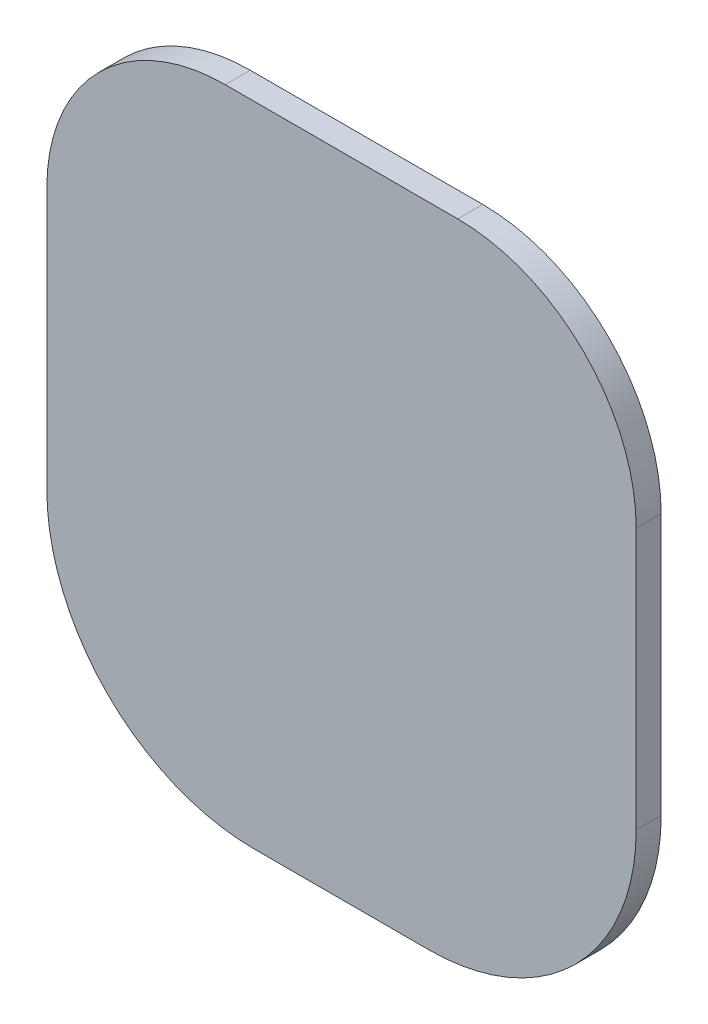
ISO-10303-21;
HEADER;
FILE_DESCRIPTION(('STEP AP214'),'2;1');
FILE_NAME('part.step','',(''),(''),'','','');
FILE_SCHEMA(('AUTOMOTIVE_DESIGN { 1 0 10303 214 1 1 1 1 }'));
ENDSEC;
DATA;
#1=APPLICATION_CONTEXT('core data for automotive mechanical design processes');
#2=APPLICATION_PROTOCOL_DEFINITION('international standard','automotive_design',2000,#1);
#3=PRODUCT_CONTEXT('',#1,'mechanical');
#4=PRODUCT('Part','Part','',(#3));
#5=PRODUCT_RELATED_PRODUCT_CATEGORY('part','',(#4));
#6=PRODUCT_DEFINITION_FORMATION('','',#4);
#7=PRODUCT_DEFINITION_CONTEXT('part definition',#1,'design');
#8=PRODUCT_DEFINITION('design','',#6,#7);
#9=PRODUCT_DEFINITION_SHAPE('','',#8);
#10=(LENGTH_UNIT() NAMED_UNIT(*) SI_UNIT(.MILLI.,.METRE.));
#11=(NAMED_UNIT(*) PLANE_ANGLE_UNIT() SI_UNIT($,.RADIAN.));
#12=(NAMED_UNIT(*) SI_UNIT($,.STERADIAN.) SOLID_ANGLE_UNIT());
#13=UNCERTAINTY_MEASURE_WITH_UNIT(LENGTH_MEASURE(1.E-05),#10,'distance_accuracy_value','');
#14=(GEOMETRIC_REPRESENTATION_CONTEXT(3) GLOBAL_UNCERTAINTY_ASSIGNED_CONTEXT((#13)) GLOBAL_UNIT_ASSIGNED_CONTEXT((#10,
#11,#12)) REPRESENTATION_CONTEXT('',''));
#15=CARTESIAN_POINT('',(0.,0.,0.));
#16=DIRECTION('',(0.,0.,1.));
#17=DIRECTION('',(1.,0.,0.));
#18=AXIS2_PLACEMENT_3D('',#15,#16,#17);
#19=CARTESIAN_POINT('',(-20.,17.,4.3));
#20=DIRECTION('',(0.,0.,-1.));
#21=DIRECTION('',(-1.,0.,0.));
#22=AXIS2_PLACEMENT_3D('',#19,#20,#21);
#23=CYLINDRICAL_SURFACE('',#22,30.7);
#24=CARTESIAN_POINT('',(-20.,17.,0.));
#25=DIRECTION('',(0.,0.,1.));
#26=DIRECTION('',(-1.,0.,0.));
#27=AXIS2_PLACEMENT_3D('',#24,#25,#26);
#28=CIRCLE('',#27,30.7);
#29=CARTESIAN_POINT('',(-20.,47.7,0.));
#30=VERTEX_POINT('',#29);
#31=CARTESIAN_POINT('',(-50.7,17.,0.));
#32=VERTEX_POINT('',#31);
#33=EDGE_CURVE('E140',#30,#32,#28,.T.);
#34=ORIENTED_EDGE('',*,*,#33,.T.);
#35=DIRECTION('',(0.,0.,-1.));
#36=VECTOR('',#35,1.);
#37=CARTESIAN_POINT('',(-50.7,17.,4.3));
#38=LINE('',#37,#36);
#39=CARTESIAN_POINT('',(-50.7,17.,4.3));
#40=VERTEX_POINT('',#39);
#41=EDGE_CURVE('E11',#40,#32,#38,.T.);
#42=ORIENTED_EDGE('',*,*,#41,.F.);
#43=CARTESIAN_POINT('',(-20.,17.,4.3));
#44=DIRECTION('',(0.,0.,1.));
#45=DIRECTION('',(-1.,0.,0.));
#46=AXIS2_PLACEMENT_3D('',#43,#44,#45);
#47=CIRCLE('',#46,30.7);
#48=CARTESIAN_POINT('',(-20.,47.7,4.3));
#49=VERTEX_POINT('',#48);
#50=EDGE_CURVE('E163',#49,#40,#47,.T.);
#51=ORIENTED_EDGE('',*,*,#50,.F.);
#52=DIRECTION('',(0.,0.,-1.));
#53=VECTOR('',#52,1.);
#54=CARTESIAN_POINT('',(-20.,47.7,4.3));
#55=LINE('',#54,#53);
#56=EDGE_CURVE('E136',#49,#30,#55,.T.);
#57=ORIENTED_EDGE('',*,*,#56,.T.);
#58=EDGE_LOOP('',(#34,#42,#51,#57));
#59=FACE_BOUND('',#58,.T.);
#60=ADVANCED_FACE('F39',(#59),#23,.T.);
#61=CARTESIAN_POINT('',(-50.7,17.,4.3));
#62=DIRECTION('',(1.,0.,0.));
#63=DIRECTION('',(0.,1.,0.));
#64=AXIS2_PLACEMENT_3D('',#61,#62,#63);
#65=PLANE('',#64);
#66=DIRECTION('',(0.,-1.,0.));
#67=VECTOR('',#66,1.);
#68=CARTESIAN_POINT('',(-50.7,17.,0.));
#69=LINE('',#68,#67);
#70=CARTESIAN_POINT('',(-50.7,-28.,0.));
#71=VERTEX_POINT('',#70);
#72=EDGE_CURVE('E144',#32,#71,#69,.T.);
#73=ORIENTED_EDGE('',*,*,#72,.T.);
#74=DIRECTION('',(0.,0.,-1.));
#75=VECTOR('',#74,1.);
#76=CARTESIAN_POINT('',(-50.7,-28.,4.3));
#77=LINE('',#76,#75);
#78=CARTESIAN_POINT('',(-50.7,-28.,4.3));
#79=VERTEX_POINT('',#78);
#80=EDGE_CURVE('E48',#79,#71,#77,.T.);
#81=ORIENTED_EDGE('',*,*,#80,.F.);
#82=DIRECTION('',(0.,-1.,0.));
#83=VECTOR('',#82,1.);
#84=CARTESIAN_POINT('',(-50.7,17.,4.3));
#85=LINE('',#84,#83);
#86=EDGE_CURVE('E99',#40,#79,#85,.T.);
#87=ORIENTED_EDGE('',*,*,#86,.F.);
#88=ORIENTED_EDGE('',*,*,#41,.T.);
#89=EDGE_LOOP('',(#73,#81,#87,#88));
#90=FACE_BOUND('',#89,.T.);
#91=ADVANCED_FACE('F208',(#90),#65,.F.);
#92=CARTESIAN_POINT('',(-15.,-28.,4.3));
#93=DIRECTION('',(0.,0.,-1.));
#94=DIRECTION('',(-1.,0.,0.));
#95=AXIS2_PLACEMENT_3D('',#92,#93,#94);
#96=CYLINDRICAL_SURFACE('',#95,35.7);
#97=CARTESIAN_POINT('',(-15.,-28.,0.));
#98=DIRECTION('',(0.,0.,1.));
#99=DIRECTION('',(1.,0.,0.));
#100=AXIS2_PLACEMENT_3D('',#97,#98,#99);
#101=CIRCLE('',#100,35.7);
#102=CARTESIAN_POINT('',(-15.,-63.7,0.));
#103=VERTEX_POINT('',#102);
#104=EDGE_CURVE('E147',#71,#103,#101,.T.);
#105=ORIENTED_EDGE('',*,*,#104,.T.);
#106=DIRECTION('',(0.,0.,-1.));
#107=VECTOR('',#106,1.);
#108=CARTESIAN_POINT('',(-15.,-63.7,4.3));
#109=LINE('',#108,#107);
#110=CARTESIAN_POINT('',(-15.,-63.7,4.3));
#111=VERTEX_POINT('',#110);
#112=EDGE_CURVE('E174',#111,#103,#109,.T.);
#113=ORIENTED_EDGE('',*,*,#112,.F.);
#114=CARTESIAN_POINT('',(-15.,-28.,4.3));
#115=DIRECTION('',(0.,0.,1.));
#116=DIRECTION('',(1.,0.,0.));
#117=AXIS2_PLACEMENT_3D('',#114,#115,#116);
#118=CIRCLE('',#117,35.7);
#119=EDGE_CURVE('E184',#79,#111,#118,.T.);
#120=ORIENTED_EDGE('',*,*,#119,.F.);
#121=ORIENTED_EDGE('',*,*,#80,.T.);
#122=EDGE_LOOP('',(#105,#113,#120,#121));
#123=FACE_BOUND('',#122,.T.);
#124=ADVANCED_FACE('F182',(#123),#96,.T.);
#125=CARTESIAN_POINT('',(0.500000000000017,-63.7,4.3));
#126=DIRECTION('',(0.,1.,0.));
#127=DIRECTION('',(0.,0.,1.));
#128=AXIS2_PLACEMENT_3D('',#125,#126,#127);
#129=PLANE('',#128);
#130=DIRECTION('',(1.,0.,0.));
#131=VECTOR('',#130,1.);
#132=CARTESIAN_POINT('',(0.500000000000017,-63.7,0.));
#133=LINE('',#132,#131);
#134=CARTESIAN_POINT('',(15.,-63.7,0.));
#135=VERTEX_POINT('',#134);
#136=EDGE_CURVE('E151',#103,#135,#133,.T.);
#137=ORIENTED_EDGE('',*,*,#136,.T.);
#138=DIRECTION('',(0.,0.,-1.));
#139=VECTOR('',#138,1.);
#140=CARTESIAN_POINT('',(15.,-63.7,4.3));
#141=LINE('',#140,#139);
#142=CARTESIAN_POINT('',(15.,-63.7,4.3));
#143=VERTEX_POINT('',#142);
#144=EDGE_CURVE('E170',#143,#135,#141,.T.);
#145=ORIENTED_EDGE('',*,*,#144,.F.);
#146=DIRECTION('',(1.,0.,0.));
#147=VECTOR('',#146,1.);
#148=CARTESIAN_POINT('',(-15.,-63.7,4.3));
#149=LINE('',#148,#147);
#150=EDGE_CURVE('E196',#111,#143,#149,.T.);
#151=ORIENTED_EDGE('',*,*,#150,.F.);
#152=ORIENTED_EDGE('',*,*,#112,.T.);
#153=EDGE_LOOP('',(#137,#145,#151,#152));
#154=FACE_BOUND('',#153,.T.);
#155=ADVANCED_FACE('F191',(#154),#129,.F.);
#156=CARTESIAN_POINT('',(15.,-28.,4.3));
#157=DIRECTION('',(0.,0.,-1.));
#158=DIRECTION('',(-1.,0.,0.));
#159=AXIS2_PLACEMENT_3D('',#156,#157,#158);
#160=CYLINDRICAL_SURFACE('',#159,35.7);
#161=CARTESIAN_POINT('',(15.,-28.,0.));
#162=DIRECTION('',(0.,0.,1.));
#163=DIRECTION('',(1.,0.,0.));
#164=AXIS2_PLACEMENT_3D('',#161,#162,#163);
#165=CIRCLE('',#164,35.7);
#166=CARTESIAN_POINT('',(50.7,-28.,0.));
#167=VERTEX_POINT('',#166);
#168=EDGE_CURVE('E154',#135,#167,#165,.T.);
#169=ORIENTED_EDGE('',*,*,#168,.T.);
#170=DIRECTION('',(0.,0.,-1.));
#171=VECTOR('',#170,1.);
#172=CARTESIAN_POINT('',(50.7,-28.,4.3));
#173=LINE('',#172,#171);
#174=CARTESIAN_POINT('',(50.7,-28.,4.3));
#175=VERTEX_POINT('',#174);
#176=EDGE_CURVE('E129',#175,#167,#173,.T.);
#177=ORIENTED_EDGE('',*,*,#176,.F.);
#178=CARTESIAN_POINT('',(15.,-28.,4.3));
#179=DIRECTION('',(0.,0.,1.));
#180=DIRECTION('',(1.,0.,0.));
#181=AXIS2_PLACEMENT_3D('',#178,#179,#180);
#182=CIRCLE('',#181,35.7);
#183=EDGE_CURVE('E118',#143,#175,#182,.T.);
#184=ORIENTED_EDGE('',*,*,#183,.F.);
#185=ORIENTED_EDGE('',*,*,#144,.T.);
#186=EDGE_LOOP('',(#169,#177,#184,#185));
#187=FACE_BOUND('',#186,.T.);
#188=ADVANCED_FACE('F194',(#187),#160,.T.);
#189=CARTESIAN_POINT('',(50.7,17.,4.3));
#190=DIRECTION('',(-1.,0.,0.));
#191=DIRECTION('',(0.,-1.,0.));
#192=AXIS2_PLACEMENT_3D('',#189,#190,#191);
#193=PLANE('',#192);
#194=DIRECTION('',(0.,1.,0.));
#195=VECTOR('',#194,1.);
#196=CARTESIAN_POINT('',(50.7,17.,0.));
#197=LINE('',#196,#195);
#198=CARTESIAN_POINT('',(50.7,17.,0.));
#199=VERTEX_POINT('',#198);
#200=EDGE_CURVE('E127',#167,#199,#197,.T.);
#201=ORIENTED_EDGE('',*,*,#200,.T.);
#202=DIRECTION('',(0.,0.,-1.));
#203=VECTOR('',#202,1.);
#204=CARTESIAN_POINT('',(50.7,17.,4.3));
#205=LINE('',#204,#203);
#206=CARTESIAN_POINT('',(50.7,17.,4.3));
#207=VERTEX_POINT('',#206);
#208=EDGE_CURVE('E124',#207,#199,#205,.T.);
#209=ORIENTED_EDGE('',*,*,#208,.F.);
#210=DIRECTION('',(0.,1.,0.));
#211=VECTOR('',#210,1.);
#212=CARTESIAN_POINT('',(50.7,17.,4.3));
#213=LINE('',#212,#211);
#214=EDGE_CURVE('E112',#175,#207,#213,.T.);
#215=ORIENTED_EDGE('',*,*,#214,.F.);
#216=ORIENTED_EDGE('',*,*,#176,.T.);
#217=EDGE_LOOP('',(#201,#209,#215,#216));
#218=FACE_BOUND('',#217,.T.);
#219=ADVANCED_FACE('F125',(#218),#193,.F.);
#220=CARTESIAN_POINT('',(20.,17.,4.3));
#221=DIRECTION('',(0.,0.,-1.));
#222=DIRECTION('',(-1.,0.,0.));
#223=AXIS2_PLACEMENT_3D('',#220,#221,#222);
#224=CYLINDRICAL_SURFACE('',#223,30.7);
#225=CARTESIAN_POINT('',(20.,17.,0.));
#226=DIRECTION('',(0.,0.,1.));
#227=DIRECTION('',(-1.,0.,0.));
#228=AXIS2_PLACEMENT_3D('',#225,#226,#227);
#229=CIRCLE('',#228,30.7);
#230=CARTESIAN_POINT('',(20.,47.7,0.));
#231=VERTEX_POINT('',#230);
#232=EDGE_CURVE('E85',#199,#231,#229,.T.);
#233=ORIENTED_EDGE('',*,*,#232,.T.);
#234=DIRECTION('',(0.,0.,-1.));
#235=VECTOR('',#234,1.);
#236=CARTESIAN_POINT('',(20.,47.7,4.3));
#237=LINE('',#236,#235);
#238=CARTESIAN_POINT('',(20.,47.7,4.3));
#239=VERTEX_POINT('',#238);
#240=EDGE_CURVE('E130',#239,#231,#237,.T.);
#241=ORIENTED_EDGE('',*,*,#240,.F.);
#242=CARTESIAN_POINT('',(20.,17.,4.3));
#243=DIRECTION('',(0.,0.,1.));
#244=DIRECTION('',(-1.,0.,0.));
#245=AXIS2_PLACEMENT_3D('',#242,#243,#244);
#246=CIRCLE('',#245,30.7);
#247=EDGE_CURVE('E116',#207,#239,#246,.T.);
#248=ORIENTED_EDGE('',*,*,#247,.F.);
#249=ORIENTED_EDGE('',*,*,#208,.T.);
#250=EDGE_LOOP('',(#233,#241,#248,#249));
#251=FACE_BOUND('',#250,.T.);
#252=ADVANCED_FACE('F132',(#251),#224,.T.);
#253=CARTESIAN_POINT('',(-20.,47.7,4.3));
#254=DIRECTION('',(0.,-1.,0.));
#255=DIRECTION('',(1.,0.,0.));
#256=AXIS2_PLACEMENT_3D('',#253,#254,#255);
#257=PLANE('',#256);
#258=DIRECTION('',(-1.,0.,0.));
#259=VECTOR('',#258,1.);
#260=CARTESIAN_POINT('',(-20.,47.7,0.));
#261=LINE('',#260,#259);
#262=EDGE_CURVE('E91',#231,#30,#261,.T.);
#263=ORIENTED_EDGE('',*,*,#262,.T.);
#264=ORIENTED_EDGE('',*,*,#56,.F.);
#265=DIRECTION('',(-1.,0.,0.));
#266=VECTOR('',#265,1.);
#267=CARTESIAN_POINT('',(-20.,47.7,4.3));
#268=LINE('',#267,#266);
#269=EDGE_CURVE('E56',#239,#49,#268,.T.);
#270=ORIENTED_EDGE('',*,*,#269,.F.);
#271=ORIENTED_EDGE('',*,*,#240,.T.);
#272=EDGE_LOOP('',(#263,#264,#270,#271));
#273=FACE_BOUND('',#272,.T.);
#274=ADVANCED_FACE('F224',(#273),#257,.F.);
#275=CARTESIAN_POINT('',(-20.,17.,4.3));
#276=DIRECTION('',(0.,0.,-1.));
#277=DIRECTION('',(-1.,0.,0.));
#278=AXIS2_PLACEMENT_3D('',#275,#276,#277);
#279=PLANE('',#278);
#280=ORIENTED_EDGE('',*,*,#50,.T.);
#281=ORIENTED_EDGE('',*,*,#86,.T.);
#282=ORIENTED_EDGE('',*,*,#119,.T.);
#283=ORIENTED_EDGE('',*,*,#150,.T.);
#284=ORIENTED_EDGE('',*,*,#183,.T.);
#285=ORIENTED_EDGE('',*,*,#214,.T.);
#286=ORIENTED_EDGE('',*,*,#247,.T.);
#287=ORIENTED_EDGE('',*,*,#269,.T.);
#288=EDGE_LOOP('',(#280,#281,#282,#283,#284,#285,#286,#287));
#289=FACE_BOUND('',#288,.T.);
#290=ADVANCED_FACE('F114',(#289),#279,.F.);
#291=CARTESIAN_POINT('',(-20.,17.,0.));
#292=DIRECTION('',(0.,0.,-1.));
#293=DIRECTION('',(-1.,0.,0.));
#294=AXIS2_PLACEMENT_3D('',#291,#292,#293);
#295=PLANE('',#294);
#296=ORIENTED_EDGE('',*,*,#33,.F.);
#297=ORIENTED_EDGE('',*,*,#262,.F.);
#298=ORIENTED_EDGE('',*,*,#232,.F.);
#299=ORIENTED_EDGE('',*,*,#200,.F.);
#300=ORIENTED_EDGE('',*,*,#168,.F.);
#301=ORIENTED_EDGE('',*,*,#136,.F.);
#302=ORIENTED_EDGE('',*,*,#104,.F.);
#303=ORIENTED_EDGE('',*,*,#72,.F.);
#304=EDGE_LOOP('',(#296,#297,#298,#299,#300,#301,#302,#303));
#305=FACE_BOUND('',#304,.T.);
#306=ADVANCED_FACE('F187',(#305),#295,.T.);
#307=CLOSED_SHELL('',(#60,#91,#124,#155,#188,#219,#252,#274,#290,#306));
#308=MANIFOLD_SOLID_BREP('B2',#307);
#309=ADVANCED_BREP_SHAPE_REPRESENTATION('',(#18,#308),#14);
#310=SHAPE_DEFINITION_REPRESENTATION(#9,#309);
ENDSEC;
END-ISO-10303-21;
